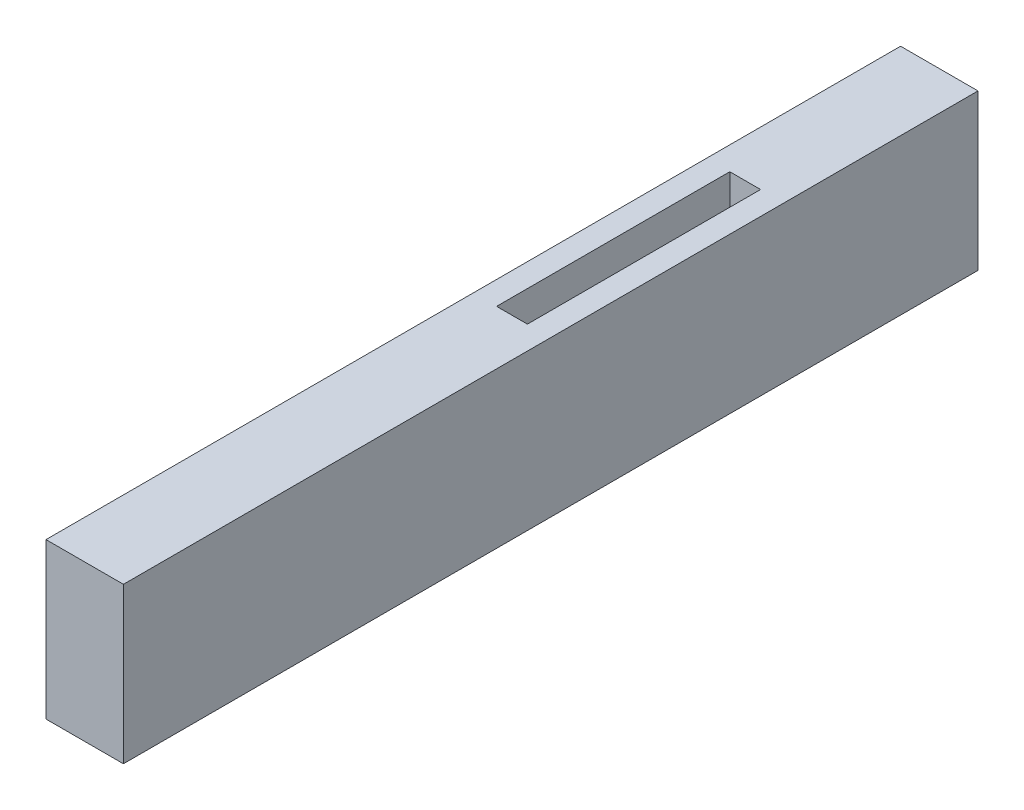
ISO-10303-21;
HEADER;
FILE_DESCRIPTION(('STEP AP214'),'2;1');
FILE_NAME('part.step','',(''),(''),'','','');
FILE_SCHEMA(('AUTOMOTIVE_DESIGN { 1 0 10303 214 1 1 1 1 }'));
ENDSEC;
DATA;
#1=APPLICATION_CONTEXT('core data for automotive mechanical design processes');
#2=APPLICATION_PROTOCOL_DEFINITION('international standard','automotive_design',2000,#1);
#3=PRODUCT_CONTEXT('',#1,'mechanical');
#4=PRODUCT('Part','Part','',(#3));
#5=PRODUCT_RELATED_PRODUCT_CATEGORY('part','',(#4));
#6=PRODUCT_DEFINITION_FORMATION('','',#4);
#7=PRODUCT_DEFINITION_CONTEXT('part definition',#1,'design');
#8=PRODUCT_DEFINITION('design','',#6,#7);
#9=PRODUCT_DEFINITION_SHAPE('','',#8);
#10=(LENGTH_UNIT() NAMED_UNIT(*) SI_UNIT(.MILLI.,.METRE.));
#11=(NAMED_UNIT(*) PLANE_ANGLE_UNIT() SI_UNIT($,.RADIAN.));
#12=(NAMED_UNIT(*) SI_UNIT($,.STERADIAN.) SOLID_ANGLE_UNIT());
#13=UNCERTAINTY_MEASURE_WITH_UNIT(LENGTH_MEASURE(1.E-05),#10,'distance_accuracy_value','');
#14=(GEOMETRIC_REPRESENTATION_CONTEXT(3) GLOBAL_UNCERTAINTY_ASSIGNED_CONTEXT((#13)) GLOBAL_UNIT_ASSIGNED_CONTEXT((#10,
#11,#12)) REPRESENTATION_CONTEXT('',''));
#15=CARTESIAN_POINT('',(0.,0.,0.));
#16=DIRECTION('',(0.,0.,1.));
#17=DIRECTION('',(1.,0.,0.));
#18=AXIS2_PLACEMENT_3D('',#15,#16,#17);
#19=CARTESIAN_POINT('',(-12.7963683314086,3.,-3.04374293507385));
#20=DIRECTION('',(0.,0.,1.));
#21=DIRECTION('',(1.,0.,0.));
#22=AXIS2_PLACEMENT_3D('',#19,#20,#21);
#23=PLANE('',#22);
#24=DIRECTION('',(1.,0.,0.));
#25=VECTOR('',#24,1.);
#26=CARTESIAN_POINT('',(-10.8156980740136,7.,-3.04374293507385));
#27=LINE('',#26,#25);
#28=CARTESIAN_POINT('',(-12.7963683314086,7.,-3.04374293507385));
#29=VERTEX_POINT('',#28);
#30=CARTESIAN_POINT('',(-10.8156980740136,7.,-3.04374293507385));
#31=VERTEX_POINT('',#30);
#32=EDGE_CURVE('E140',#29,#31,#27,.T.);
#33=ORIENTED_EDGE('',*,*,#32,.F.);
#34=DIRECTION('',(0.,1.,0.));
#35=VECTOR('',#34,1.);
#36=CARTESIAN_POINT('',(-12.7963683314086,3.,-3.04374293507385));
#37=LINE('',#36,#35);
#38=CARTESIAN_POINT('',(-12.7963683314086,10.,-3.04374293507385));
#39=VERTEX_POINT('',#38);
#40=EDGE_CURVE('E63',#29,#39,#37,.T.);
#41=ORIENTED_EDGE('',*,*,#40,.T.);
#42=DIRECTION('',(1.,0.,0.));
#43=VECTOR('',#42,1.);
#44=CARTESIAN_POINT('',(-12.7963683314086,10.,-3.04374293507385));
#45=LINE('',#44,#43);
#46=CARTESIAN_POINT('',(-10.8156980740136,10.,-3.04374293507385));
#47=VERTEX_POINT('',#46);
#48=EDGE_CURVE('E200',#39,#47,#45,.T.);
#49=ORIENTED_EDGE('',*,*,#48,.T.);
#50=DIRECTION('',(0.,1.,0.));
#51=VECTOR('',#50,1.);
#52=CARTESIAN_POINT('',(-10.8156980740136,3.,-3.04374293507385));
#53=LINE('',#52,#51);
#54=EDGE_CURVE('E216',#31,#47,#53,.T.);
#55=ORIENTED_EDGE('',*,*,#54,.F.);
#56=EDGE_LOOP('',(#33,#41,#49,#55));
#57=FACE_BOUND('',#56,.T.);
#58=ADVANCED_FACE('F39',(#57),#23,.F.);
#59=CARTESIAN_POINT('',(-14.2963683314086,10.,24.442178114987));
#60=DIRECTION('',(1.,0.,0.));
#61=DIRECTION('',(0.,0.,-1.));
#62=AXIS2_PLACEMENT_3D('',#59,#60,#61);
#63=PLANE('',#62);
#64=DIRECTION('',(0.,0.,1.));
#65=VECTOR('',#64,1.);
#66=CARTESIAN_POINT('',(-14.2963683314086,0.,24.442178114987));
#67=LINE('',#66,#65);
#68=CARTESIAN_POINT('',(-14.2963683314086,0.,-30.5296639851347));
#69=VERTEX_POINT('',#68);
#70=CARTESIAN_POINT('',(-14.2963683314086,0.,24.442178114987));
#71=VERTEX_POINT('',#70);
#72=EDGE_CURVE('E212',#69,#71,#67,.T.);
#73=ORIENTED_EDGE('',*,*,#72,.T.);
#74=DIRECTION('',(0.,-1.,0.));
#75=VECTOR('',#74,1.);
#76=CARTESIAN_POINT('',(-14.2963683314086,10.,24.442178114987));
#77=LINE('',#76,#75);
#78=CARTESIAN_POINT('',(-14.2963683314086,10.,24.442178114987));
#79=VERTEX_POINT('',#78);
#80=EDGE_CURVE('E11',#79,#71,#77,.T.);
#81=ORIENTED_EDGE('',*,*,#80,.F.);
#82=DIRECTION('',(0.,0.,1.));
#83=VECTOR('',#82,1.);
#84=CARTESIAN_POINT('',(-14.2963683314086,10.,24.442178114987));
#85=LINE('',#84,#83);
#86=CARTESIAN_POINT('',(-14.2963683314086,10.,-30.5296639851347));
#87=VERTEX_POINT('',#86);
#88=EDGE_CURVE('E221',#87,#79,#85,.T.);
#89=ORIENTED_EDGE('',*,*,#88,.F.);
#90=DIRECTION('',(0.,-1.,0.));
#91=VECTOR('',#90,1.);
#92=CARTESIAN_POINT('',(-14.2963683314086,10.,-30.5296639851347));
#93=LINE('',#92,#91);
#94=EDGE_CURVE('E235',#87,#69,#93,.T.);
#95=ORIENTED_EDGE('',*,*,#94,.T.);
#96=EDGE_LOOP('',(#73,#81,#89,#95));
#97=FACE_BOUND('',#96,.T.);
#98=ADVANCED_FACE('F41',(#97),#63,.F.);
#99=CARTESIAN_POINT('',(-9.31569807401334,10.,24.442178114987));
#100=DIRECTION('',(0.,0.,-1.));
#101=DIRECTION('',(-1.,0.,0.));
#102=AXIS2_PLACEMENT_3D('',#99,#100,#101);
#103=PLANE('',#102);
#104=DIRECTION('',(1.,0.,0.));
#105=VECTOR('',#104,1.);
#106=CARTESIAN_POINT('',(-9.31569807401334,0.,24.442178114987));
#107=LINE('',#106,#105);
#108=CARTESIAN_POINT('',(-9.31569807401334,0.,24.442178114987));
#109=VERTEX_POINT('',#108);
#110=EDGE_CURVE('E239',#71,#109,#107,.T.);
#111=ORIENTED_EDGE('',*,*,#110,.T.);
#112=DIRECTION('',(0.,-1.,0.));
#113=VECTOR('',#112,1.);
#114=CARTESIAN_POINT('',(-9.31569807401334,10.,24.442178114987));
#115=LINE('',#114,#113);
#116=CARTESIAN_POINT('',(-9.31569807401334,10.,24.442178114987));
#117=VERTEX_POINT('',#116);
#118=EDGE_CURVE('E48',#117,#109,#115,.T.);
#119=ORIENTED_EDGE('',*,*,#118,.F.);
#120=DIRECTION('',(1.,0.,0.));
#121=VECTOR('',#120,1.);
#122=CARTESIAN_POINT('',(-9.31569807401334,10.,24.442178114987));
#123=LINE('',#122,#121);
#124=EDGE_CURVE('E225',#79,#117,#123,.T.);
#125=ORIENTED_EDGE('',*,*,#124,.F.);
#126=ORIENTED_EDGE('',*,*,#80,.T.);
#127=EDGE_LOOP('',(#111,#119,#125,#126));
#128=FACE_BOUND('',#127,.T.);
#129=ADVANCED_FACE('F275',(#128),#103,.F.);
#130=CARTESIAN_POINT('',(-9.31569807401392,10.,-30.5296639851347));
#131=DIRECTION('',(-1.,0.,0.));
#132=DIRECTION('',(0.,0.,1.));
#133=AXIS2_PLACEMENT_3D('',#130,#131,#132);
#134=PLANE('',#133);
#135=DIRECTION('',(0.,0.,-1.));
#136=VECTOR('',#135,1.);
#137=CARTESIAN_POINT('',(-9.31569807401392,0.,-30.5296639851347));
#138=LINE('',#137,#136);
#139=CARTESIAN_POINT('',(-9.31569807401392,0.,-30.5296639851347));
#140=VERTEX_POINT('',#139);
#141=EDGE_CURVE('E242',#109,#140,#138,.T.);
#142=ORIENTED_EDGE('',*,*,#141,.T.);
#143=DIRECTION('',(0.,-1.,0.));
#144=VECTOR('',#143,1.);
#145=CARTESIAN_POINT('',(-9.31569807401392,10.,-30.5296639851347));
#146=LINE('',#145,#144);
#147=CARTESIAN_POINT('',(-9.31569807401392,10.,-30.5296639851347));
#148=VERTEX_POINT('',#147);
#149=EDGE_CURVE('E250',#148,#140,#146,.T.);
#150=ORIENTED_EDGE('',*,*,#149,.F.);
#151=DIRECTION('',(0.,0.,-1.));
#152=VECTOR('',#151,1.);
#153=CARTESIAN_POINT('',(-9.31569807401392,10.,-30.5296639851347));
#154=LINE('',#153,#152);
#155=EDGE_CURVE('E229',#117,#148,#154,.T.);
#156=ORIENTED_EDGE('',*,*,#155,.F.);
#157=ORIENTED_EDGE('',*,*,#118,.T.);
#158=EDGE_LOOP('',(#142,#150,#156,#157));
#159=FACE_BOUND('',#158,.T.);
#160=ADVANCED_FACE('F259',(#159),#134,.F.);
#161=CARTESIAN_POINT('',(-14.2963683314086,10.,-30.5296639851347));
#162=DIRECTION('',(0.,0.,1.));
#163=DIRECTION('',(1.,0.,0.));
#164=AXIS2_PLACEMENT_3D('',#161,#162,#163);
#165=PLANE('',#164);
#166=DIRECTION('',(-1.,0.,0.));
#167=VECTOR('',#166,1.);
#168=CARTESIAN_POINT('',(-14.2963683314086,0.,-30.5296639851347));
#169=LINE('',#168,#167);
#170=EDGE_CURVE('E226',#140,#69,#169,.T.);
#171=ORIENTED_EDGE('',*,*,#170,.T.);
#172=ORIENTED_EDGE('',*,*,#94,.F.);
#173=DIRECTION('',(-1.,0.,0.));
#174=VECTOR('',#173,1.);
#175=CARTESIAN_POINT('',(-14.2963683314086,10.,-30.5296639851347));
#176=LINE('',#175,#174);
#177=EDGE_CURVE('E232',#148,#87,#176,.T.);
#178=ORIENTED_EDGE('',*,*,#177,.F.);
#179=ORIENTED_EDGE('',*,*,#149,.T.);
#180=EDGE_LOOP('',(#171,#172,#178,#179));
#181=FACE_BOUND('',#180,.T.);
#182=ADVANCED_FACE('F268',(#181),#165,.F.);
#183=CARTESIAN_POINT('',(0.,10.,0.));
#184=DIRECTION('',(0.,-1.,0.));
#185=DIRECTION('',(0.,0.,-1.));
#186=AXIS2_PLACEMENT_3D('',#183,#184,#185);
#187=PLANE('',#186);
#188=ORIENTED_EDGE('',*,*,#48,.F.);
#189=DIRECTION('',(0.,0.,1.));
#190=VECTOR('',#189,1.);
#191=CARTESIAN_POINT('',(-12.7963683314086,10.,-18.0437429350739));
#192=LINE('',#191,#190);
#193=CARTESIAN_POINT('',(-12.7963683314086,10.,-18.0437429350739));
#194=VERTEX_POINT('',#193);
#195=EDGE_CURVE('E175',#194,#39,#192,.T.);
#196=ORIENTED_EDGE('',*,*,#195,.F.);
#197=DIRECTION('',(-1.,0.,0.));
#198=VECTOR('',#197,1.);
#199=CARTESIAN_POINT('',(-12.7963683314086,10.,-18.0437429350739));
#200=LINE('',#199,#198);
#201=CARTESIAN_POINT('',(-10.8156980740138,10.,-18.0437429350739));
#202=VERTEX_POINT('',#201);
#203=EDGE_CURVE('E186',#202,#194,#200,.T.);
#204=ORIENTED_EDGE('',*,*,#203,.F.);
#205=DIRECTION('',(0.,0.,-1.));
#206=VECTOR('',#205,1.);
#207=CARTESIAN_POINT('',(-10.8156980740136,10.,-3.04374293507385));
#208=LINE('',#207,#206);
#209=EDGE_CURVE('E203',#47,#202,#208,.T.);
#210=ORIENTED_EDGE('',*,*,#209,.F.);
#211=EDGE_LOOP('',(#188,#196,#204,#210));
#212=FACE_BOUND('',#211,.T.);
#213=ORIENTED_EDGE('',*,*,#88,.T.);
#214=ORIENTED_EDGE('',*,*,#124,.T.);
#215=ORIENTED_EDGE('',*,*,#155,.T.);
#216=ORIENTED_EDGE('',*,*,#177,.T.);
#217=EDGE_LOOP('',(#213,#214,#215,#216));
#218=FACE_BOUND('',#217,.T.);
#219=ADVANCED_FACE('F274',(#212,#218),#187,.F.);
#220=CARTESIAN_POINT('',(0.,0.,0.));
#221=DIRECTION('',(0.,-1.,0.));
#222=DIRECTION('',(0.,0.,-1.));
#223=AXIS2_PLACEMENT_3D('',#220,#221,#222);
#224=PLANE('',#223);
#225=DIRECTION('',(0.,0.,1.));
#226=VECTOR('',#225,1.);
#227=CARTESIAN_POINT('',(-10.8156980740136,0.,-3.04374293507385));
#228=LINE('',#227,#226);
#229=CARTESIAN_POINT('',(-10.8156980740136,0.,-3.04374293507385));
#230=VERTEX_POINT('',#229);
#231=CARTESIAN_POINT('',(-10.8156980740134,0.,22.942178114987));
#232=VERTEX_POINT('',#231);
#233=EDGE_CURVE('E55',#230,#232,#228,.T.);
#234=ORIENTED_EDGE('',*,*,#233,.F.);
#235=DIRECTION('',(1.,0.,0.));
#236=VECTOR('',#235,1.);
#237=CARTESIAN_POINT('',(-10.8156980740136,0.,-3.04374293507385));
#238=LINE('',#237,#236);
#239=CARTESIAN_POINT('',(-12.7963683314086,0.,-3.04374293507385));
#240=VERTEX_POINT('',#239);
#241=EDGE_CURVE('E153',#240,#230,#238,.T.);
#242=ORIENTED_EDGE('',*,*,#241,.F.);
#243=DIRECTION('',(0.,0.,-1.));
#244=VECTOR('',#243,1.);
#245=CARTESIAN_POINT('',(-12.7963683314086,0.,22.942178114987));
#246=LINE('',#245,#244);
#247=CARTESIAN_POINT('',(-12.7963683314086,0.,22.942178114987));
#248=VERTEX_POINT('',#247);
#249=EDGE_CURVE('E157',#248,#240,#246,.T.);
#250=ORIENTED_EDGE('',*,*,#249,.F.);
#251=DIRECTION('',(-1.,0.,0.));
#252=VECTOR('',#251,1.);
#253=CARTESIAN_POINT('',(-10.8156980740134,0.,22.942178114987));
#254=LINE('',#253,#252);
#255=EDGE_CURVE('E166',#232,#248,#254,.T.);
#256=ORIENTED_EDGE('',*,*,#255,.F.);
#257=EDGE_LOOP('',(#234,#242,#250,#256));
#258=FACE_BOUND('',#257,.T.);
#259=ORIENTED_EDGE('',*,*,#72,.F.);
#260=ORIENTED_EDGE('',*,*,#170,.F.);
#261=ORIENTED_EDGE('',*,*,#141,.F.);
#262=ORIENTED_EDGE('',*,*,#110,.F.);
#263=EDGE_LOOP('',(#259,#260,#261,#262));
#264=FACE_BOUND('',#263,.T.);
#265=ADVANCED_FACE('F265',(#258,#264),#224,.T.);
#266=CARTESIAN_POINT('',(-12.7963683314086,3.,-18.0437429350739));
#267=DIRECTION('',(-1.,0.,0.));
#268=DIRECTION('',(0.,0.,1.));
#269=AXIS2_PLACEMENT_3D('',#266,#267,#268);
#270=PLANE('',#269);
#271=ORIENTED_EDGE('',*,*,#195,.T.);
#272=ORIENTED_EDGE('',*,*,#40,.F.);
#273=DIRECTION('',(0.,0.,-1.));
#274=VECTOR('',#273,1.);
#275=CARTESIAN_POINT('',(-12.7963683314086,7.,22.942178114987));
#276=LINE('',#275,#274);
#277=CARTESIAN_POINT('',(-12.7963683314086,7.,22.942178114987));
#278=VERTEX_POINT('',#277);
#279=EDGE_CURVE('E148',#278,#29,#276,.T.);
#280=ORIENTED_EDGE('',*,*,#279,.F.);
#281=DIRECTION('',(0.,-1.,0.));
#282=VECTOR('',#281,1.);
#283=CARTESIAN_POINT('',(-12.7963683314086,7.,22.942178114987));
#284=LINE('',#283,#282);
#285=EDGE_CURVE('E139',#278,#248,#284,.T.);
#286=ORIENTED_EDGE('',*,*,#285,.T.);
#287=ORIENTED_EDGE('',*,*,#249,.T.);
#288=DIRECTION('',(0.,-1.,0.));
#289=VECTOR('',#288,1.);
#290=CARTESIAN_POINT('',(-12.7963683314086,7.,-3.04374293507385));
#291=LINE('',#290,#289);
#292=CARTESIAN_POINT('',(-12.7963683314086,3.,-3.04374293507385));
#293=VERTEX_POINT('',#292);
#294=EDGE_CURVE('E176',#293,#240,#291,.T.);
#295=ORIENTED_EDGE('',*,*,#294,.F.);
#296=DIRECTION('',(0.,0.,1.));
#297=VECTOR('',#296,1.);
#298=CARTESIAN_POINT('',(-12.7963683314086,3.,-18.0437429350739));
#299=LINE('',#298,#297);
#300=CARTESIAN_POINT('',(-12.7963683314086,3.,-18.0437429350739));
#301=VERTEX_POINT('',#300);
#302=EDGE_CURVE('E181',#301,#293,#299,.T.);
#303=ORIENTED_EDGE('',*,*,#302,.F.);
#304=DIRECTION('',(0.,1.,0.));
#305=VECTOR('',#304,1.);
#306=CARTESIAN_POINT('',(-12.7963683314086,3.,-18.0437429350739));
#307=LINE('',#306,#305);
#308=EDGE_CURVE('E209',#301,#194,#307,.T.);
#309=ORIENTED_EDGE('',*,*,#308,.T.);
#310=EDGE_LOOP('',(#271,#272,#280,#286,#287,#295,#303,#309));
#311=FACE_BOUND('',#310,.T.);
#312=ADVANCED_FACE('F289',(#311),#270,.F.);
#313=CARTESIAN_POINT('',(-12.7963683314086,3.,-18.0437429350739));
#314=DIRECTION('',(0.,0.,-1.));
#315=DIRECTION('',(-1.,0.,0.));
#316=AXIS2_PLACEMENT_3D('',#313,#314,#315);
#317=PLANE('',#316);
#318=ORIENTED_EDGE('',*,*,#203,.T.);
#319=ORIENTED_EDGE('',*,*,#308,.F.);
#320=DIRECTION('',(-1.,0.,0.));
#321=VECTOR('',#320,1.);
#322=CARTESIAN_POINT('',(-12.7963683314086,3.,-18.0437429350739));
#323=LINE('',#322,#321);
#324=CARTESIAN_POINT('',(-10.8156980740138,3.,-18.0437429350739));
#325=VERTEX_POINT('',#324);
#326=EDGE_CURVE('E194',#325,#301,#323,.T.);
#327=ORIENTED_EDGE('',*,*,#326,.F.);
#328=DIRECTION('',(0.,1.,0.));
#329=VECTOR('',#328,1.);
#330=CARTESIAN_POINT('',(-10.8156980740138,3.,-18.0437429350739));
#331=LINE('',#330,#329);
#332=EDGE_CURVE('E213',#325,#202,#331,.T.);
#333=ORIENTED_EDGE('',*,*,#332,.T.);
#334=EDGE_LOOP('',(#318,#319,#327,#333));
#335=FACE_BOUND('',#334,.T.);
#336=ADVANCED_FACE('F292',(#335),#317,.F.);
#337=CARTESIAN_POINT('',(-10.8156980740136,3.,-3.04374293507385));
#338=DIRECTION('',(1.,0.,0.));
#339=DIRECTION('',(0.,0.,-1.));
#340=AXIS2_PLACEMENT_3D('',#337,#338,#339);
#341=PLANE('',#340);
#342=ORIENTED_EDGE('',*,*,#209,.T.);
#343=ORIENTED_EDGE('',*,*,#332,.F.);
#344=DIRECTION('',(0.,0.,-1.));
#345=VECTOR('',#344,1.);
#346=CARTESIAN_POINT('',(-10.8156980740136,3.,-3.04374293507385));
#347=LINE('',#346,#345);
#348=CARTESIAN_POINT('',(-10.8156980740136,3.,-3.04374293507385));
#349=VERTEX_POINT('',#348);
#350=EDGE_CURVE('E190',#349,#325,#347,.T.);
#351=ORIENTED_EDGE('',*,*,#350,.F.);
#352=DIRECTION('',(0.,-1.,0.));
#353=VECTOR('',#352,1.);
#354=CARTESIAN_POINT('',(-10.8156980740136,7.,-3.04374293507385));
#355=LINE('',#354,#353);
#356=EDGE_CURVE('E172',#349,#230,#355,.T.);
#357=ORIENTED_EDGE('',*,*,#356,.T.);
#358=ORIENTED_EDGE('',*,*,#233,.T.);
#359=DIRECTION('',(0.,-1.,0.));
#360=VECTOR('',#359,1.);
#361=CARTESIAN_POINT('',(-10.8156980740134,7.,22.942178114987));
#362=LINE('',#361,#360);
#363=CARTESIAN_POINT('',(-10.8156980740134,7.,22.942178114987));
#364=VERTEX_POINT('',#363);
#365=EDGE_CURVE('E128',#364,#232,#362,.T.);
#366=ORIENTED_EDGE('',*,*,#365,.F.);
#367=DIRECTION('',(0.,0.,1.));
#368=VECTOR('',#367,1.);
#369=CARTESIAN_POINT('',(-10.8156980740136,7.,-3.04374293507385));
#370=LINE('',#369,#368);
#371=EDGE_CURVE('E133',#31,#364,#370,.T.);
#372=ORIENTED_EDGE('',*,*,#371,.F.);
#373=ORIENTED_EDGE('',*,*,#54,.T.);
#374=EDGE_LOOP('',(#342,#343,#351,#357,#358,#366,#372,#373));
#375=FACE_BOUND('',#374,.T.);
#376=ADVANCED_FACE('F131',(#375),#341,.F.);
#377=CARTESIAN_POINT('',(0.,3.,0.));
#378=DIRECTION('',(0.,1.,0.));
#379=DIRECTION('',(0.,0.,1.));
#380=AXIS2_PLACEMENT_3D('',#377,#378,#379);
#381=PLANE('',#380);
#382=ORIENTED_EDGE('',*,*,#302,.T.);
#383=DIRECTION('',(1.,0.,0.));
#384=VECTOR('',#383,1.);
#385=CARTESIAN_POINT('',(-12.7963683314086,3.,-3.04374293507385));
#386=LINE('',#385,#384);
#387=EDGE_CURVE('E185',#293,#349,#386,.T.);
#388=ORIENTED_EDGE('',*,*,#387,.T.);
#389=ORIENTED_EDGE('',*,*,#350,.T.);
#390=ORIENTED_EDGE('',*,*,#326,.T.);
#391=EDGE_LOOP('',(#382,#388,#389,#390));
#392=FACE_BOUND('',#391,.T.);
#393=ADVANCED_FACE('F329',(#392),#381,.T.);
#394=CARTESIAN_POINT('',(-10.8156980740136,7.,-3.04374293507385));
#395=DIRECTION('',(0.,0.,-1.));
#396=DIRECTION('',(-1.,0.,0.));
#397=AXIS2_PLACEMENT_3D('',#394,#395,#396);
#398=PLANE('',#397);
#399=ORIENTED_EDGE('',*,*,#387,.F.);
#400=ORIENTED_EDGE('',*,*,#294,.T.);
#401=ORIENTED_EDGE('',*,*,#241,.T.);
#402=ORIENTED_EDGE('',*,*,#356,.F.);
#403=EDGE_LOOP('',(#399,#400,#401,#402));
#404=FACE_BOUND('',#403,.T.);
#405=ADVANCED_FACE('F335',(#404),#398,.F.);
#406=CARTESIAN_POINT('',(-10.8156980740134,7.,22.942178114987));
#407=DIRECTION('',(0.,0.,1.));
#408=DIRECTION('',(1.,0.,0.));
#409=AXIS2_PLACEMENT_3D('',#406,#407,#408);
#410=PLANE('',#409);
#411=ORIENTED_EDGE('',*,*,#255,.T.);
#412=ORIENTED_EDGE('',*,*,#285,.F.);
#413=DIRECTION('',(-1.,0.,0.));
#414=VECTOR('',#413,1.);
#415=CARTESIAN_POINT('',(-10.8156980740134,7.,22.942178114987));
#416=LINE('',#415,#414);
#417=EDGE_CURVE('E143',#364,#278,#416,.T.);
#418=ORIENTED_EDGE('',*,*,#417,.F.);
#419=ORIENTED_EDGE('',*,*,#365,.T.);
#420=EDGE_LOOP('',(#411,#412,#418,#419));
#421=FACE_BOUND('',#420,.T.);
#422=ADVANCED_FACE('F144',(#421),#410,.F.);
#423=CARTESIAN_POINT('',(0.,7.,0.));
#424=DIRECTION('',(0.,-1.,0.));
#425=DIRECTION('',(0.,0.,-1.));
#426=AXIS2_PLACEMENT_3D('',#423,#424,#425);
#427=PLANE('',#426);
#428=ORIENTED_EDGE('',*,*,#371,.T.);
#429=ORIENTED_EDGE('',*,*,#417,.T.);
#430=ORIENTED_EDGE('',*,*,#279,.T.);
#431=ORIENTED_EDGE('',*,*,#32,.T.);
#432=EDGE_LOOP('',(#428,#429,#430,#431));
#433=FACE_BOUND('',#432,.T.);
#434=ADVANCED_FACE('F150',(#433),#427,.T.);
#435=CLOSED_SHELL('',(#58,#98,#129,#160,#182,#219,#265,#312,#336,#376,#393,#405,#422,#434));
#436=MANIFOLD_SOLID_BREP('B2',#435);
#437=ADVANCED_BREP_SHAPE_REPRESENTATION('',(#18,#436),#14);
#438=SHAPE_DEFINITION_REPRESENTATION(#9,#437);
ENDSEC;
END-ISO-10303-21;
